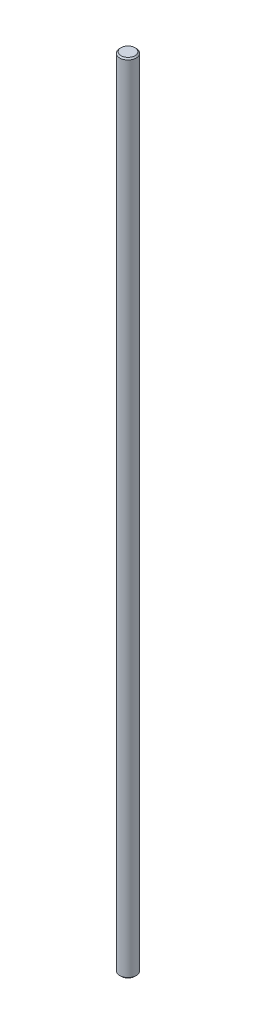
ISO-10303-21;
HEADER;
FILE_DESCRIPTION(('STEP AP214'),'2;1');
FILE_NAME('part.step','',(''),(''),'','','');
FILE_SCHEMA(('AUTOMOTIVE_DESIGN { 1 0 10303 214 1 1 1 1 }'));
ENDSEC;
DATA;
#1=APPLICATION_CONTEXT('core data for automotive mechanical design processes');
#2=APPLICATION_PROTOCOL_DEFINITION('international standard','automotive_design',2000,#1);
#3=PRODUCT_CONTEXT('',#1,'mechanical');
#4=PRODUCT('Part','Part','',(#3));
#5=PRODUCT_RELATED_PRODUCT_CATEGORY('part','',(#4));
#6=PRODUCT_DEFINITION_FORMATION('','',#4);
#7=PRODUCT_DEFINITION_CONTEXT('part definition',#1,'design');
#8=PRODUCT_DEFINITION('design','',#6,#7);
#9=PRODUCT_DEFINITION_SHAPE('','',#8);
#10=(LENGTH_UNIT() NAMED_UNIT(*) SI_UNIT(.MILLI.,.METRE.));
#11=(NAMED_UNIT(*) PLANE_ANGLE_UNIT() SI_UNIT($,.RADIAN.));
#12=(NAMED_UNIT(*) SI_UNIT($,.STERADIAN.) SOLID_ANGLE_UNIT());
#13=UNCERTAINTY_MEASURE_WITH_UNIT(LENGTH_MEASURE(1.E-05),#10,'distance_accuracy_value','');
#14=(GEOMETRIC_REPRESENTATION_CONTEXT(3) GLOBAL_UNCERTAINTY_ASSIGNED_CONTEXT((#13)) GLOBAL_UNIT_ASSIGNED_CONTEXT((#10,
#11,#12)) REPRESENTATION_CONTEXT('',''));
#15=CARTESIAN_POINT('',(0.,0.,0.));
#16=DIRECTION('',(0.,0.,1.));
#17=DIRECTION('',(1.,0.,0.));
#18=AXIS2_PLACEMENT_3D('',#15,#16,#17);
#19=CARTESIAN_POINT('',(-2.84217017566743E-11,0.508000000000286,0.));
#20=DIRECTION('',(0.,1.,0.));
#21=DIRECTION('',(-1.,0.,0.));
#22=AXIS2_PLACEMENT_3D('',#19,#20,#21);
#23=CONICAL_SURFACE('',#22,3.17118999993615,0.785398163397448);
#24=CARTESIAN_POINT('',(-2.84217017566743E-11,2.84217017566743E-11,0.));
#25=DIRECTION('',(0.,1.,0.));
#26=DIRECTION('',(-1.,0.,0.));
#27=AXIS2_PLACEMENT_3D('',#24,#25,#26);
#28=CIRCLE('',#27,2.66318999996429);
#29=CARTESIAN_POINT('',(-2.66318999999271,2.84217017566743E-11,0.));
#30=VERTEX_POINT('',#29);
#31=EDGE_CURVE('E45',#30,#30,#28,.T.);
#32=ORIENTED_EDGE('',*,*,#31,.T.);
#33=EDGE_LOOP('',(#32));
#34=FACE_BOUND('',#33,.T.);
#35=CARTESIAN_POINT('',(-2.84217017566743E-11,0.508000000000286,0.));
#36=DIRECTION('',(0.,1.,0.));
#37=DIRECTION('',(-1.,0.,0.));
#38=AXIS2_PLACEMENT_3D('',#35,#36,#37);
#39=CIRCLE('',#38,3.17118999993615);
#40=CARTESIAN_POINT('',(-3.17118999996457,0.508000000000286,0.));
#41=VERTEX_POINT('',#40);
#42=EDGE_CURVE('E10',#41,#41,#39,.T.);
#43=ORIENTED_EDGE('',*,*,#42,.F.);
#44=EDGE_LOOP('',(#43));
#45=FACE_BOUND('',#44,.T.);
#46=ADVANCED_FACE('F31',(#34,#45),#23,.T.);
#47=CARTESIAN_POINT('',(-2.84217017566743E-11,2.84217017566743E-11,0.));
#48=DIRECTION('',(0.,1.,0.));
#49=DIRECTION('',(-1.,0.,0.));
#50=AXIS2_PLACEMENT_3D('',#47,#48,#49);
#51=CYLINDRICAL_SURFACE('',#50,3.17118999993617);
#52=ORIENTED_EDGE('',*,*,#42,.T.);
#53=EDGE_LOOP('',(#52));
#54=FACE_BOUND('',#53,.T.);
#55=CARTESIAN_POINT('',(-2.84217017566743E-11,304.292,0.));
#56=DIRECTION('',(0.,1.,0.));
#57=DIRECTION('',(-1.,0.,0.));
#58=AXIS2_PLACEMENT_3D('',#55,#56,#57);
#59=CIRCLE('',#58,3.17118999993619);
#60=CARTESIAN_POINT('',(-3.17118999996461,304.292,0.));
#61=VERTEX_POINT('',#60);
#62=EDGE_CURVE('E37',#61,#61,#59,.T.);
#63=ORIENTED_EDGE('',*,*,#62,.F.);
#64=EDGE_LOOP('',(#63));
#65=FACE_BOUND('',#64,.T.);
#66=ADVANCED_FACE('F64',(#54,#65),#51,.T.);
#67=CARTESIAN_POINT('',(-2.84217017566743E-11,304.8,0.));
#68=DIRECTION('',(0.,-1.,0.));
#69=DIRECTION('',(1.,0.,0.));
#70=AXIS2_PLACEMENT_3D('',#67,#68,#69);
#71=CONICAL_SURFACE('',#70,2.66318999993617,0.785398163397462);
#72=ORIENTED_EDGE('',*,*,#62,.T.);
#73=EDGE_LOOP('',(#72));
#74=FACE_BOUND('',#73,.T.);
#75=CARTESIAN_POINT('',(-2.84217017566743E-11,304.8,0.));
#76=DIRECTION('',(0.,1.,0.));
#77=DIRECTION('',(-1.,0.,0.));
#78=AXIS2_PLACEMENT_3D('',#75,#76,#77);
#79=CIRCLE('',#78,2.66318999993617);
#80=CARTESIAN_POINT('',(-2.66318999996459,304.8,0.));
#81=VERTEX_POINT('',#80);
#82=EDGE_CURVE('E41',#81,#81,#79,.T.);
#83=ORIENTED_EDGE('',*,*,#82,.F.);
#84=EDGE_LOOP('',(#83));
#85=FACE_BOUND('',#84,.T.);
#86=ADVANCED_FACE('F60',(#74,#85),#71,.T.);
#87=CARTESIAN_POINT('',(-2.84217017566743E-11,304.8,0.));
#88=DIRECTION('',(0.,1.,0.));
#89=DIRECTION('',(-1.,0.,0.));
#90=AXIS2_PLACEMENT_3D('',#87,#88,#89);
#91=PLANE('',#90);
#92=ORIENTED_EDGE('',*,*,#82,.T.);
#93=EDGE_LOOP('',(#92));
#94=FACE_BOUND('',#93,.T.);
#95=ADVANCED_FACE('F55',(#94),#91,.T.);
#96=CARTESIAN_POINT('',(2.66318999993587,2.84217017566743E-11,0.));
#97=DIRECTION('',(0.,-1.,0.));
#98=DIRECTION('',(1.,0.,0.));
#99=AXIS2_PLACEMENT_3D('',#96,#97,#98);
#100=PLANE('',#99);
#101=ORIENTED_EDGE('',*,*,#31,.F.);
#102=EDGE_LOOP('',(#101));
#103=FACE_BOUND('',#102,.T.);
#104=ADVANCED_FACE('F53',(#103),#100,.T.);
#105=CLOSED_SHELL('',(#46,#66,#86,#95,#104));
#106=MANIFOLD_SOLID_BREP('B2',#105);
#107=ADVANCED_BREP_SHAPE_REPRESENTATION('',(#18,#106),#14);
#108=SHAPE_DEFINITION_REPRESENTATION(#9,#107);
ENDSEC;
END-ISO-10303-21;
